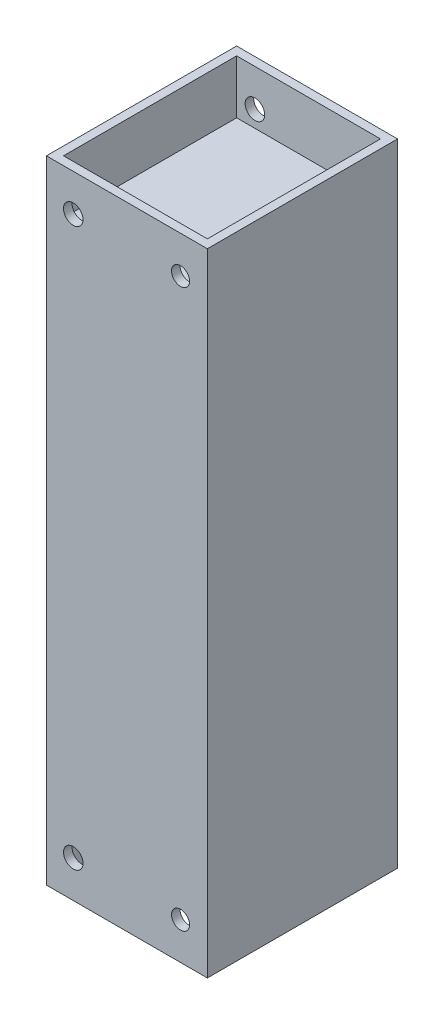
ISO-10303-21;
HEADER;
FILE_DESCRIPTION(('STEP AP214'),'2;1');
FILE_NAME('part.step','',(''),(''),'','','');
FILE_SCHEMA(('AUTOMOTIVE_DESIGN { 1 0 10303 214 1 1 1 1 }'));
ENDSEC;
DATA;
#1=APPLICATION_CONTEXT('core data for automotive mechanical design processes');
#2=APPLICATION_PROTOCOL_DEFINITION('international standard','automotive_design',2000,#1);
#3=PRODUCT_CONTEXT('',#1,'mechanical');
#4=PRODUCT('Part','Part','',(#3));
#5=PRODUCT_RELATED_PRODUCT_CATEGORY('part','',(#4));
#6=PRODUCT_DEFINITION_FORMATION('','',#4);
#7=PRODUCT_DEFINITION_CONTEXT('part definition',#1,'design');
#8=PRODUCT_DEFINITION('design','',#6,#7);
#9=PRODUCT_DEFINITION_SHAPE('','',#8);
#10=(LENGTH_UNIT() NAMED_UNIT(*) SI_UNIT(.MILLI.,.METRE.));
#11=(NAMED_UNIT(*) PLANE_ANGLE_UNIT() SI_UNIT($,.RADIAN.));
#12=(NAMED_UNIT(*) SI_UNIT($,.STERADIAN.) SOLID_ANGLE_UNIT());
#13=UNCERTAINTY_MEASURE_WITH_UNIT(LENGTH_MEASURE(1.E-05),#10,'distance_accuracy_value','');
#14=(GEOMETRIC_REPRESENTATION_CONTEXT(3) GLOBAL_UNCERTAINTY_ASSIGNED_CONTEXT((#13)) GLOBAL_UNIT_ASSIGNED_CONTEXT((#10,
#11,#12)) REPRESENTATION_CONTEXT('',''));
#15=CARTESIAN_POINT('',(0.,0.,0.));
#16=DIRECTION('',(0.,0.,1.));
#17=DIRECTION('',(1.,0.,0.));
#18=AXIS2_PLACEMENT_3D('',#15,#16,#17);
#19=CARTESIAN_POINT('',(-61.5591316556863,13.,4.59211236862001));
#20=DIRECTION('',(1.,0.,0.));
#21=DIRECTION('',(0.,0.,-1.));
#22=AXIS2_PLACEMENT_3D('',#19,#20,#21);
#23=PLANE('',#22);
#24=DIRECTION('',(0.,-1.,0.));
#25=VECTOR('',#24,1.);
#26=CARTESIAN_POINT('',(-61.5591316556863,13.,4.59211236862001));
#27=LINE('',#26,#25);
#28=CARTESIAN_POINT('',(-61.5591316556863,13.,4.59211236862001));
#29=VERTEX_POINT('',#28);
#30=CARTESIAN_POINT('',(-61.5591316556863,-116.499999756,4.59211236862001));
#31=VERTEX_POINT('',#30);
#32=EDGE_CURVE('E62',#29,#31,#27,.T.);
#33=ORIENTED_EDGE('',*,*,#32,.T.);
#34=DIRECTION('',(0.,0.,1.));
#35=VECTOR('',#34,1.);
#36=CARTESIAN_POINT('',(-61.5591316556863,-116.499999756,4.59211236862001));
#37=LINE('',#36,#35);
#38=CARTESIAN_POINT('',(-61.5591316556863,-116.499999756,43.59211236862));
#39=VERTEX_POINT('',#38);
#40=EDGE_CURVE('E167',#31,#39,#37,.T.);
#41=ORIENTED_EDGE('',*,*,#40,.T.);
#42=DIRECTION('',(0.,-1.,0.));
#43=VECTOR('',#42,1.);
#44=CARTESIAN_POINT('',(-61.5591316556863,13.,43.59211236862));
#45=LINE('',#44,#43);
#46=CARTESIAN_POINT('',(-61.5591316556863,13.,43.59211236862));
#47=VERTEX_POINT('',#46);
#48=EDGE_CURVE('E12',#47,#39,#45,.T.);
#49=ORIENTED_EDGE('',*,*,#48,.F.);
#50=DIRECTION('',(0.,0.,1.));
#51=VECTOR('',#50,1.);
#52=CARTESIAN_POINT('',(-61.5591316556863,13.,4.59211236862001));
#53=LINE('',#52,#51);
#54=EDGE_CURVE('E235',#29,#47,#53,.T.);
#55=ORIENTED_EDGE('',*,*,#54,.F.);
#56=EDGE_LOOP('',(#33,#41,#49,#55));
#57=FACE_BOUND('',#56,.T.);
#58=ADVANCED_FACE('F38',(#57),#23,.F.);
#59=CARTESIAN_POINT('',(-61.5591316556863,13.,43.59211236862));
#60=DIRECTION('',(0.,0.,-1.));
#61=DIRECTION('',(-1.,0.,0.));
#62=AXIS2_PLACEMENT_3D('',#59,#60,#61);
#63=PLANE('',#62);
#64=CARTESIAN_POINT('',(-34.0591316556863,5.4,43.59211236862));
#65=DIRECTION('',(0.,0.,1.));
#66=DIRECTION('',(1.,0.,0.));
#67=AXIS2_PLACEMENT_3D('',#64,#65,#66);
#68=CIRCLE('',#67,1.85);
#69=CARTESIAN_POINT('',(-32.2091316556863,5.4,43.59211236862));
#70=VERTEX_POINT('',#69);
#71=EDGE_CURVE('E191',#70,#70,#68,.T.);
#72=ORIENTED_EDGE('',*,*,#71,.F.);
#73=EDGE_LOOP('',(#72));
#74=FACE_BOUND('',#73,.T.);
#75=CARTESIAN_POINT('',(-56.0591316556863,5.4,43.59211236862));
#76=DIRECTION('',(0.,0.,1.));
#77=DIRECTION('',(1.,0.,0.));
#78=AXIS2_PLACEMENT_3D('',#75,#76,#77);
#79=CIRCLE('',#78,2.);
#80=CARTESIAN_POINT('',(-54.0591316556863,5.4,43.59211236862));
#81=VERTEX_POINT('',#80);
#82=EDGE_CURVE('E180',#81,#81,#79,.T.);
#83=ORIENTED_EDGE('',*,*,#82,.F.);
#84=EDGE_LOOP('',(#83));
#85=FACE_BOUND('',#84,.T.);
#86=ORIENTED_EDGE('',*,*,#48,.T.);
#87=DIRECTION('',(1.,0.,0.));
#88=VECTOR('',#87,1.);
#89=CARTESIAN_POINT('',(-61.5591316556863,-116.499999756,43.59211236862));
#90=LINE('',#89,#88);
#91=CARTESIAN_POINT('',(-28.5591316556863,-116.499999756,43.59211236862));
#92=VERTEX_POINT('',#91);
#93=EDGE_CURVE('E171',#39,#92,#90,.T.);
#94=ORIENTED_EDGE('',*,*,#93,.T.);
#95=DIRECTION('',(0.,-1.,0.));
#96=VECTOR('',#95,1.);
#97=CARTESIAN_POINT('',(-28.5591316556863,13.,43.59211236862));
#98=LINE('',#97,#96);
#99=CARTESIAN_POINT('',(-28.5591316556863,13.,43.59211236862));
#100=VERTEX_POINT('',#99);
#101=EDGE_CURVE('E46',#100,#92,#98,.T.);
#102=ORIENTED_EDGE('',*,*,#101,.F.);
#103=DIRECTION('',(1.,0.,0.));
#104=VECTOR('',#103,1.);
#105=CARTESIAN_POINT('',(-61.5591316556863,13.,43.59211236862));
#106=LINE('',#105,#104);
#107=EDGE_CURVE('E238',#47,#100,#106,.T.);
#108=ORIENTED_EDGE('',*,*,#107,.F.);
#109=EDGE_LOOP('',(#86,#94,#102,#108));
#110=FACE_BOUND('',#109,.T.);
#111=CARTESIAN_POINT('',(-34.0591316556863,-108.899999756,43.59211236862));
#112=DIRECTION('',(0.,0.,-1.));
#113=DIRECTION('',(1.,0.,0.));
#114=AXIS2_PLACEMENT_3D('',#111,#112,#113);
#115=CIRCLE('',#114,1.85);
#116=CARTESIAN_POINT('',(-32.2091316556863,-108.899999756,43.59211236862));
#117=VERTEX_POINT('',#116);
#118=EDGE_CURVE('E185',#117,#117,#115,.T.);
#119=ORIENTED_EDGE('',*,*,#118,.T.);
#120=EDGE_LOOP('',(#119));
#121=FACE_BOUND('',#120,.T.);
#122=CARTESIAN_POINT('',(-56.0591316556863,-108.899999756,43.59211236862));
#123=DIRECTION('',(0.,0.,-1.));
#124=DIRECTION('',(1.,0.,0.));
#125=AXIS2_PLACEMENT_3D('',#122,#123,#124);
#126=CIRCLE('',#125,2.);
#127=CARTESIAN_POINT('',(-54.0591316556863,-108.899999756,43.59211236862));
#128=VERTEX_POINT('',#127);
#129=EDGE_CURVE('E386',#128,#128,#126,.T.);
#130=ORIENTED_EDGE('',*,*,#129,.T.);
#131=EDGE_LOOP('',(#130));
#132=FACE_BOUND('',#131,.T.);
#133=ADVANCED_FACE('F273',(#74,#85,#110,#121,#132),#63,.F.);
#134=CARTESIAN_POINT('',(-28.5591316556863,13.,4.59211236862001));
#135=DIRECTION('',(1.,0.,0.));
#136=DIRECTION('',(0.,0.,-1.));
#137=AXIS2_PLACEMENT_3D('',#134,#135,#136);
#138=PLANE('',#137);
#139=ORIENTED_EDGE('',*,*,#101,.T.);
#140=DIRECTION('',(0.,0.,1.));
#141=VECTOR('',#140,1.);
#142=CARTESIAN_POINT('',(-28.5591316556863,-116.499999756,4.59211236862001));
#143=LINE('',#142,#141);
#144=CARTESIAN_POINT('',(-28.5591316556863,-116.499999756,4.59211236862001));
#145=VERTEX_POINT('',#144);
#146=EDGE_CURVE('E174',#145,#92,#143,.T.);
#147=ORIENTED_EDGE('',*,*,#146,.F.);
#148=DIRECTION('',(0.,-1.,0.));
#149=VECTOR('',#148,1.);
#150=CARTESIAN_POINT('',(-28.5591316556863,13.,4.59211236862001));
#151=LINE('',#150,#149);
#152=CARTESIAN_POINT('',(-28.5591316556863,13.,4.59211236862001));
#153=VERTEX_POINT('',#152);
#154=EDGE_CURVE('E246',#153,#145,#151,.T.);
#155=ORIENTED_EDGE('',*,*,#154,.F.);
#156=DIRECTION('',(0.,0.,1.));
#157=VECTOR('',#156,1.);
#158=CARTESIAN_POINT('',(-28.5591316556863,13.,4.59211236862001));
#159=LINE('',#158,#157);
#160=EDGE_CURVE('E240',#153,#100,#159,.T.);
#161=ORIENTED_EDGE('',*,*,#160,.T.);
#162=EDGE_LOOP('',(#139,#147,#155,#161));
#163=FACE_BOUND('',#162,.T.);
#164=ADVANCED_FACE('F278',(#163),#138,.T.);
#165=CARTESIAN_POINT('',(-61.5591316556863,13.,4.59211236862001));
#166=DIRECTION('',(0.,0.,-1.));
#167=DIRECTION('',(-1.,0.,0.));
#168=AXIS2_PLACEMENT_3D('',#165,#166,#167);
#169=PLANE('',#168);
#170=CARTESIAN_POINT('',(-34.0591316556863,5.4,4.59211236862001));
#171=DIRECTION('',(0.,0.,-1.));
#172=DIRECTION('',(-1.,0.,0.));
#173=AXIS2_PLACEMENT_3D('',#170,#171,#172);
#174=CIRCLE('',#173,1.85);
#175=CARTESIAN_POINT('',(-35.9091316556863,5.4,4.59211236862001));
#176=VERTEX_POINT('',#175);
#177=EDGE_CURVE('E206',#176,#176,#174,.T.);
#178=ORIENTED_EDGE('',*,*,#177,.F.);
#179=EDGE_LOOP('',(#178));
#180=FACE_BOUND('',#179,.T.);
#181=CARTESIAN_POINT('',(-56.0591316556863,5.4,4.59211236862001));
#182=DIRECTION('',(0.,0.,-1.));
#183=DIRECTION('',(-1.,0.,0.));
#184=AXIS2_PLACEMENT_3D('',#181,#182,#183);
#185=CIRCLE('',#184,2.);
#186=CARTESIAN_POINT('',(-58.0591316556863,5.4,4.59211236862001));
#187=VERTEX_POINT('',#186);
#188=EDGE_CURVE('E200',#187,#187,#185,.T.);
#189=ORIENTED_EDGE('',*,*,#188,.F.);
#190=EDGE_LOOP('',(#189));
#191=FACE_BOUND('',#190,.T.);
#192=ORIENTED_EDGE('',*,*,#154,.T.);
#193=DIRECTION('',(1.,0.,0.));
#194=VECTOR('',#193,1.);
#195=CARTESIAN_POINT('',(-61.5591316556863,-116.499999756,4.59211236862001));
#196=LINE('',#195,#194);
#197=EDGE_CURVE('E177',#31,#145,#196,.T.);
#198=ORIENTED_EDGE('',*,*,#197,.F.);
#199=ORIENTED_EDGE('',*,*,#32,.F.);
#200=DIRECTION('',(1.,0.,0.));
#201=VECTOR('',#200,1.);
#202=CARTESIAN_POINT('',(-61.5591316556863,13.,4.59211236862001));
#203=LINE('',#202,#201);
#204=EDGE_CURVE('E243',#29,#153,#203,.T.);
#205=ORIENTED_EDGE('',*,*,#204,.T.);
#206=EDGE_LOOP('',(#192,#198,#199,#205));
#207=FACE_BOUND('',#206,.T.);
#208=CARTESIAN_POINT('',(-34.0591316556863,-108.899999756,4.59211236862001));
#209=DIRECTION('',(0.,0.,1.));
#210=DIRECTION('',(-1.,0.,0.));
#211=AXIS2_PLACEMENT_3D('',#208,#209,#210);
#212=CIRCLE('',#211,1.85);
#213=CARTESIAN_POINT('',(-35.9091316556863,-108.899999756,4.59211236862001));
#214=VERTEX_POINT('',#213);
#215=EDGE_CURVE('E156',#214,#214,#212,.T.);
#216=ORIENTED_EDGE('',*,*,#215,.T.);
#217=EDGE_LOOP('',(#216));
#218=FACE_BOUND('',#217,.T.);
#219=CARTESIAN_POINT('',(-56.0591316556863,-108.899999756,4.59211236862001));
#220=DIRECTION('',(0.,0.,1.));
#221=DIRECTION('',(-1.,0.,0.));
#222=AXIS2_PLACEMENT_3D('',#219,#220,#221);
#223=CIRCLE('',#222,2.);
#224=CARTESIAN_POINT('',(-58.0591316556863,-108.899999756,4.59211236862001));
#225=VERTEX_POINT('',#224);
#226=EDGE_CURVE('E190',#225,#225,#223,.T.);
#227=ORIENTED_EDGE('',*,*,#226,.T.);
#228=EDGE_LOOP('',(#227));
#229=FACE_BOUND('',#228,.T.);
#230=ADVANCED_FACE('F283',(#180,#191,#207,#218,#229),#169,.T.);
#231=CARTESIAN_POINT('',(0.,13.,0.));
#232=DIRECTION('',(0.,1.,0.));
#233=DIRECTION('',(0.,0.,1.));
#234=AXIS2_PLACEMENT_3D('',#231,#232,#233);
#235=PLANE('',#234);
#236=DIRECTION('',(0.,0.,1.));
#237=VECTOR('',#236,1.);
#238=CARTESIAN_POINT('',(-59.8091316556863,13.,6.34211236862001));
#239=LINE('',#238,#237);
#240=CARTESIAN_POINT('',(-59.8091316556863,13.,6.34211236862001));
#241=VERTEX_POINT('',#240);
#242=CARTESIAN_POINT('',(-59.8091316556863,13.,41.84211236862));
#243=VERTEX_POINT('',#242);
#244=EDGE_CURVE('E54',#241,#243,#239,.T.);
#245=ORIENTED_EDGE('',*,*,#244,.F.);
#246=DIRECTION('',(-1.,0.,0.));
#247=VECTOR('',#246,1.);
#248=CARTESIAN_POINT('',(-59.8091316556863,13.,6.34211236862001));
#249=LINE('',#248,#247);
#250=CARTESIAN_POINT('',(-30.3091316556863,13.,6.34211236862001));
#251=VERTEX_POINT('',#250);
#252=EDGE_CURVE('E224',#251,#241,#249,.T.);
#253=ORIENTED_EDGE('',*,*,#252,.F.);
#254=DIRECTION('',(0.,0.,-1.));
#255=VECTOR('',#254,1.);
#256=CARTESIAN_POINT('',(-30.3091316556863,13.,6.34211236862001));
#257=LINE('',#256,#255);
#258=CARTESIAN_POINT('',(-30.3091316556863,13.,41.84211236862));
#259=VERTEX_POINT('',#258);
#260=EDGE_CURVE('E221',#259,#251,#257,.T.);
#261=ORIENTED_EDGE('',*,*,#260,.F.);
#262=DIRECTION('',(1.,0.,0.));
#263=VECTOR('',#262,1.);
#264=CARTESIAN_POINT('',(-59.8091316556863,13.,41.84211236862));
#265=LINE('',#264,#263);
#266=EDGE_CURVE('E218',#243,#259,#265,.T.);
#267=ORIENTED_EDGE('',*,*,#266,.F.);
#268=EDGE_LOOP('',(#245,#253,#261,#267));
#269=FACE_BOUND('',#268,.T.);
#270=ORIENTED_EDGE('',*,*,#54,.T.);
#271=ORIENTED_EDGE('',*,*,#107,.T.);
#272=ORIENTED_EDGE('',*,*,#160,.F.);
#273=ORIENTED_EDGE('',*,*,#204,.F.);
#274=EDGE_LOOP('',(#270,#271,#272,#273));
#275=FACE_BOUND('',#274,.T.);
#276=ADVANCED_FACE('F292',(#269,#275),#235,.T.);
#277=CARTESIAN_POINT('',(-59.8091316556863,-46.1573396113771,6.34211236862001));
#278=DIRECTION('',(-1.,0.,0.));
#279=DIRECTION('',(0.,0.,1.));
#280=AXIS2_PLACEMENT_3D('',#277,#278,#279);
#281=PLANE('',#280);
#282=DIRECTION('',(0.,0.,-1.));
#283=VECTOR('',#282,1.);
#284=CARTESIAN_POINT('',(-59.8091316556863,2.,6.34211236862001));
#285=LINE('',#284,#283);
#286=CARTESIAN_POINT('',(-59.8091316556863,2.,41.84211236862));
#287=VERTEX_POINT('',#286);
#288=CARTESIAN_POINT('',(-59.8091316556863,2.,6.34211236862001));
#289=VERTEX_POINT('',#288);
#290=EDGE_CURVE('E214',#287,#289,#285,.T.);
#291=ORIENTED_EDGE('',*,*,#290,.T.);
#292=DIRECTION('',(0.,1.,0.));
#293=VECTOR('',#292,1.);
#294=CARTESIAN_POINT('',(-59.8091316556863,-46.1573396113771,6.34211236862001));
#295=LINE('',#294,#293);
#296=EDGE_CURVE('E212',#289,#241,#295,.T.);
#297=ORIENTED_EDGE('',*,*,#296,.T.);
#298=ORIENTED_EDGE('',*,*,#244,.T.);
#299=DIRECTION('',(0.,1.,0.));
#300=VECTOR('',#299,1.);
#301=CARTESIAN_POINT('',(-59.8091316556863,-46.1573396113771,41.84211236862));
#302=LINE('',#301,#300);
#303=EDGE_CURVE('E227',#287,#243,#302,.T.);
#304=ORIENTED_EDGE('',*,*,#303,.F.);
#305=EDGE_LOOP('',(#291,#297,#298,#304));
#306=FACE_BOUND('',#305,.T.);
#307=ADVANCED_FACE('F304',(#306),#281,.F.);
#308=CARTESIAN_POINT('',(-59.8091316556863,-46.1573396113771,6.34211236862001));
#309=DIRECTION('',(0.,0.,-1.));
#310=DIRECTION('',(-1.,0.,0.));
#311=AXIS2_PLACEMENT_3D('',#308,#309,#310);
#312=PLANE('',#311);
#313=CARTESIAN_POINT('',(-34.0591316556863,5.4,6.34211236862001));
#314=DIRECTION('',(0.,0.,-1.));
#315=DIRECTION('',(-1.,0.,0.));
#316=AXIS2_PLACEMENT_3D('',#313,#314,#315);
#317=CIRCLE('',#316,1.85);
#318=CARTESIAN_POINT('',(-35.9091316556863,5.4,6.34211236862001));
#319=VERTEX_POINT('',#318);
#320=EDGE_CURVE('E203',#319,#319,#317,.T.);
#321=ORIENTED_EDGE('',*,*,#320,.T.);
#322=EDGE_LOOP('',(#321));
#323=FACE_BOUND('',#322,.T.);
#324=CARTESIAN_POINT('',(-56.0591316556863,5.4,6.34211236862001));
#325=DIRECTION('',(0.,0.,-1.));
#326=DIRECTION('',(-1.,0.,0.));
#327=AXIS2_PLACEMENT_3D('',#324,#325,#326);
#328=CIRCLE('',#327,2.);
#329=CARTESIAN_POINT('',(-58.0591316556863,5.4,6.34211236862001));
#330=VERTEX_POINT('',#329);
#331=EDGE_CURVE('E197',#330,#330,#328,.T.);
#332=ORIENTED_EDGE('',*,*,#331,.T.);
#333=EDGE_LOOP('',(#332));
#334=FACE_BOUND('',#333,.T.);
#335=DIRECTION('',(1.,0.,0.));
#336=VECTOR('',#335,1.);
#337=CARTESIAN_POINT('',(-59.8091316556863,2.,6.34211236862001));
#338=LINE('',#337,#336);
#339=CARTESIAN_POINT('',(-30.3091316556863,2.,6.34211236862001));
#340=VERTEX_POINT('',#339);
#341=EDGE_CURVE('E211',#289,#340,#338,.T.);
#342=ORIENTED_EDGE('',*,*,#341,.T.);
#343=DIRECTION('',(0.,1.,0.));
#344=VECTOR('',#343,1.);
#345=CARTESIAN_POINT('',(-30.3091316556863,-46.1573396113771,6.34211236862001));
#346=LINE('',#345,#344);
#347=EDGE_CURVE('E229',#340,#251,#346,.T.);
#348=ORIENTED_EDGE('',*,*,#347,.T.);
#349=ORIENTED_EDGE('',*,*,#252,.T.);
#350=ORIENTED_EDGE('',*,*,#296,.F.);
#351=EDGE_LOOP('',(#342,#348,#349,#350));
#352=FACE_BOUND('',#351,.T.);
#353=ADVANCED_FACE('F308',(#323,#334,#352),#312,.F.);
#354=CARTESIAN_POINT('',(-30.3091316556863,-46.1573396113771,6.34211236862001));
#355=DIRECTION('',(1.,0.,0.));
#356=DIRECTION('',(0.,0.,-1.));
#357=AXIS2_PLACEMENT_3D('',#354,#355,#356);
#358=PLANE('',#357);
#359=DIRECTION('',(0.,0.,1.));
#360=VECTOR('',#359,1.);
#361=CARTESIAN_POINT('',(-30.3091316556863,2.,6.34211236862001));
#362=LINE('',#361,#360);
#363=CARTESIAN_POINT('',(-30.3091316556863,2.,41.84211236862));
#364=VERTEX_POINT('',#363);
#365=EDGE_CURVE('E209',#340,#364,#362,.T.);
#366=ORIENTED_EDGE('',*,*,#365,.T.);
#367=DIRECTION('',(0.,1.,0.));
#368=VECTOR('',#367,1.);
#369=CARTESIAN_POINT('',(-30.3091316556863,-46.1573396113771,41.84211236862));
#370=LINE('',#369,#368);
#371=EDGE_CURVE('E231',#364,#259,#370,.T.);
#372=ORIENTED_EDGE('',*,*,#371,.T.);
#373=ORIENTED_EDGE('',*,*,#260,.T.);
#374=ORIENTED_EDGE('',*,*,#347,.F.);
#375=EDGE_LOOP('',(#366,#372,#373,#374));
#376=FACE_BOUND('',#375,.T.);
#377=ADVANCED_FACE('F311',(#376),#358,.F.);
#378=CARTESIAN_POINT('',(-59.8091316556863,-46.1573396113771,41.84211236862));
#379=DIRECTION('',(0.,0.,1.));
#380=DIRECTION('',(1.,0.,0.));
#381=AXIS2_PLACEMENT_3D('',#378,#379,#380);
#382=PLANE('',#381);
#383=CARTESIAN_POINT('',(-34.0591316556863,5.4,41.84211236862));
#384=DIRECTION('',(0.,0.,1.));
#385=DIRECTION('',(1.,0.,0.));
#386=AXIS2_PLACEMENT_3D('',#383,#384,#385);
#387=CIRCLE('',#386,1.85);
#388=CARTESIAN_POINT('',(-32.2091316556863,5.4,41.84211236862));
#389=VERTEX_POINT('',#388);
#390=EDGE_CURVE('E41',#389,#389,#387,.T.);
#391=ORIENTED_EDGE('',*,*,#390,.T.);
#392=EDGE_LOOP('',(#391));
#393=FACE_BOUND('',#392,.T.);
#394=CARTESIAN_POINT('',(-56.0591316556863,5.4,41.84211236862));
#395=DIRECTION('',(0.,0.,1.));
#396=DIRECTION('',(1.,0.,0.));
#397=AXIS2_PLACEMENT_3D('',#394,#395,#396);
#398=CIRCLE('',#397,2.);
#399=CARTESIAN_POINT('',(-54.0591316556863,5.4,41.84211236862));
#400=VERTEX_POINT('',#399);
#401=EDGE_CURVE('E194',#400,#400,#398,.T.);
#402=ORIENTED_EDGE('',*,*,#401,.T.);
#403=EDGE_LOOP('',(#402));
#404=FACE_BOUND('',#403,.T.);
#405=DIRECTION('',(-1.,0.,0.));
#406=VECTOR('',#405,1.);
#407=CARTESIAN_POINT('',(-59.8091316556863,2.,41.84211236862));
#408=LINE('',#407,#406);
#409=EDGE_CURVE('E216',#364,#287,#408,.T.);
#410=ORIENTED_EDGE('',*,*,#409,.T.);
#411=ORIENTED_EDGE('',*,*,#303,.T.);
#412=ORIENTED_EDGE('',*,*,#266,.T.);
#413=ORIENTED_EDGE('',*,*,#371,.F.);
#414=EDGE_LOOP('',(#410,#411,#412,#413));
#415=FACE_BOUND('',#414,.T.);
#416=ADVANCED_FACE('F251',(#393,#404,#415),#382,.F.);
#417=CARTESIAN_POINT('',(0.,2.,0.));
#418=DIRECTION('',(0.,1.,0.));
#419=DIRECTION('',(0.,0.,1.));
#420=AXIS2_PLACEMENT_3D('',#417,#418,#419);
#421=PLANE('',#420);
#422=ORIENTED_EDGE('',*,*,#290,.F.);
#423=ORIENTED_EDGE('',*,*,#409,.F.);
#424=ORIENTED_EDGE('',*,*,#365,.F.);
#425=ORIENTED_EDGE('',*,*,#341,.F.);
#426=EDGE_LOOP('',(#422,#423,#424,#425));
#427=FACE_BOUND('',#426,.T.);
#428=ADVANCED_FACE('F257',(#427),#421,.T.);
#429=CARTESIAN_POINT('',(-56.0591316556863,5.4,-13.40788763138));
#430=DIRECTION('',(0.,0.,1.));
#431=DIRECTION('',(1.,0.,0.));
#432=AXIS2_PLACEMENT_3D('',#429,#430,#431);
#433=CYLINDRICAL_SURFACE('',#432,2.);
#434=ORIENTED_EDGE('',*,*,#82,.T.);
#435=EDGE_LOOP('',(#434));
#436=FACE_BOUND('',#435,.T.);
#437=ORIENTED_EDGE('',*,*,#401,.F.);
#438=EDGE_LOOP('',(#437));
#439=FACE_BOUND('',#438,.T.);
#440=ADVANCED_FACE('F254',(#436,#439),#433,.F.);
#441=CARTESIAN_POINT('',(-34.0591316556863,5.4,-13.40788763138));
#442=DIRECTION('',(0.,0.,1.));
#443=DIRECTION('',(1.,0.,0.));
#444=AXIS2_PLACEMENT_3D('',#441,#442,#443);
#445=CYLINDRICAL_SURFACE('',#444,1.85);
#446=ORIENTED_EDGE('',*,*,#71,.T.);
#447=EDGE_LOOP('',(#446));
#448=FACE_BOUND('',#447,.T.);
#449=ORIENTED_EDGE('',*,*,#390,.F.);
#450=EDGE_LOOP('',(#449));
#451=FACE_BOUND('',#450,.T.);
#452=ADVANCED_FACE('F256',(#448,#451),#445,.F.);
#453=ORIENTED_EDGE('',*,*,#188,.T.);
#454=EDGE_LOOP('',(#453));
#455=FACE_BOUND('',#454,.T.);
#456=ORIENTED_EDGE('',*,*,#331,.F.);
#457=EDGE_LOOP('',(#456));
#458=FACE_BOUND('',#457,.T.);
#459=ADVANCED_FACE('F260',(#455,#458),#433,.F.);
#460=ORIENTED_EDGE('',*,*,#177,.T.);
#461=EDGE_LOOP('',(#460));
#462=FACE_BOUND('',#461,.T.);
#463=ORIENTED_EDGE('',*,*,#320,.F.);
#464=EDGE_LOOP('',(#463));
#465=FACE_BOUND('',#464,.T.);
#466=ADVANCED_FACE('F267',(#462,#465),#445,.F.);
#467=CARTESIAN_POINT('',(0.,-116.499999756,0.));
#468=DIRECTION('',(0.,-1.,0.));
#469=DIRECTION('',(0.,0.,1.));
#470=AXIS2_PLACEMENT_3D('',#467,#468,#469);
#471=PLANE('',#470);
#472=DIRECTION('',(0.,0.,1.));
#473=VECTOR('',#472,1.);
#474=CARTESIAN_POINT('',(-59.8091316556863,-116.499999756,6.34211236862001));
#475=LINE('',#474,#473);
#476=CARTESIAN_POINT('',(-59.8091316556863,-116.499999756,6.34211236862001));
#477=VERTEX_POINT('',#476);
#478=CARTESIAN_POINT('',(-59.8091316556863,-116.499999756,41.84211236862));
#479=VERTEX_POINT('',#478);
#480=EDGE_CURVE('E154',#477,#479,#475,.T.);
#481=ORIENTED_EDGE('',*,*,#480,.T.);
#482=DIRECTION('',(1.,0.,0.));
#483=VECTOR('',#482,1.);
#484=CARTESIAN_POINT('',(-59.8091316556863,-116.499999756,41.84211236862));
#485=LINE('',#484,#483);
#486=CARTESIAN_POINT('',(-30.3091316556863,-116.499999756,41.84211236862));
#487=VERTEX_POINT('',#486);
#488=EDGE_CURVE('E134',#479,#487,#485,.T.);
#489=ORIENTED_EDGE('',*,*,#488,.T.);
#490=DIRECTION('',(0.,0.,-1.));
#491=VECTOR('',#490,1.);
#492=CARTESIAN_POINT('',(-30.3091316556863,-116.499999756,6.34211236862001));
#493=LINE('',#492,#491);
#494=CARTESIAN_POINT('',(-30.3091316556863,-116.499999756,6.34211236862001));
#495=VERTEX_POINT('',#494);
#496=EDGE_CURVE('E143',#487,#495,#493,.T.);
#497=ORIENTED_EDGE('',*,*,#496,.T.);
#498=DIRECTION('',(-1.,0.,0.));
#499=VECTOR('',#498,1.);
#500=CARTESIAN_POINT('',(-59.8091316556863,-116.499999756,6.34211236862001));
#501=LINE('',#500,#499);
#502=EDGE_CURVE('E149',#495,#477,#501,.T.);
#503=ORIENTED_EDGE('',*,*,#502,.T.);
#504=EDGE_LOOP('',(#481,#489,#497,#503));
#505=FACE_BOUND('',#504,.T.);
#506=ORIENTED_EDGE('',*,*,#40,.F.);
#507=ORIENTED_EDGE('',*,*,#197,.T.);
#508=ORIENTED_EDGE('',*,*,#146,.T.);
#509=ORIENTED_EDGE('',*,*,#93,.F.);
#510=EDGE_LOOP('',(#506,#507,#508,#509));
#511=FACE_BOUND('',#510,.T.);
#512=ADVANCED_FACE('F151',(#505,#511),#471,.T.);
#513=CARTESIAN_POINT('',(-59.8091316556863,-57.3426601446229,6.34211236862001));
#514=DIRECTION('',(-1.,0.,0.));
#515=DIRECTION('',(0.,0.,1.));
#516=AXIS2_PLACEMENT_3D('',#513,#514,#515);
#517=PLANE('',#516);
#518=DIRECTION('',(0.,0.,-1.));
#519=VECTOR('',#518,1.);
#520=CARTESIAN_POINT('',(-59.8091316556863,-105.499999756,6.34211236862001));
#521=LINE('',#520,#519);
#522=CARTESIAN_POINT('',(-59.8091316556863,-105.499999756,41.84211236862));
#523=VERTEX_POINT('',#522);
#524=CARTESIAN_POINT('',(-59.8091316556863,-105.499999756,6.34211236862001));
#525=VERTEX_POINT('',#524);
#526=EDGE_CURVE('E168',#523,#525,#521,.T.);
#527=ORIENTED_EDGE('',*,*,#526,.F.);
#528=DIRECTION('',(0.,-1.,0.));
#529=VECTOR('',#528,1.);
#530=CARTESIAN_POINT('',(-59.8091316556863,-57.3426601446229,41.84211236862));
#531=LINE('',#530,#529);
#532=EDGE_CURVE('E140',#523,#479,#531,.T.);
#533=ORIENTED_EDGE('',*,*,#532,.T.);
#534=ORIENTED_EDGE('',*,*,#480,.F.);
#535=DIRECTION('',(0.,-1.,0.));
#536=VECTOR('',#535,1.);
#537=CARTESIAN_POINT('',(-59.8091316556863,-57.3426601446229,6.34211236862001));
#538=LINE('',#537,#536);
#539=EDGE_CURVE('E161',#525,#477,#538,.T.);
#540=ORIENTED_EDGE('',*,*,#539,.F.);
#541=EDGE_LOOP('',(#527,#533,#534,#540));
#542=FACE_BOUND('',#541,.T.);
#543=ADVANCED_FACE('F341',(#542),#517,.F.);
#544=CARTESIAN_POINT('',(-59.8091316556863,-57.3426601446229,6.34211236862001));
#545=DIRECTION('',(0.,0.,-1.));
#546=DIRECTION('',(-1.,0.,0.));
#547=AXIS2_PLACEMENT_3D('',#544,#545,#546);
#548=PLANE('',#547);
#549=CARTESIAN_POINT('',(-34.0591316556863,-108.899999756,6.34211236862001));
#550=DIRECTION('',(0.,0.,1.));
#551=DIRECTION('',(-1.,0.,0.));
#552=AXIS2_PLACEMENT_3D('',#549,#550,#551);
#553=CIRCLE('',#552,1.85);
#554=CARTESIAN_POINT('',(-35.9091316556863,-108.899999756,6.34211236862001));
#555=VERTEX_POINT('',#554);
#556=EDGE_CURVE('E189',#555,#555,#553,.T.);
#557=ORIENTED_EDGE('',*,*,#556,.F.);
#558=EDGE_LOOP('',(#557));
#559=FACE_BOUND('',#558,.T.);
#560=CARTESIAN_POINT('',(-56.0591316556863,-108.899999756,6.34211236862001));
#561=DIRECTION('',(0.,0.,1.));
#562=DIRECTION('',(-1.,0.,0.));
#563=AXIS2_PLACEMENT_3D('',#560,#561,#562);
#564=CIRCLE('',#563,2.);
#565=CARTESIAN_POINT('',(-58.0591316556863,-108.899999756,6.34211236862001));
#566=VERTEX_POINT('',#565);
#567=EDGE_CURVE('E184',#566,#566,#564,.T.);
#568=ORIENTED_EDGE('',*,*,#567,.F.);
#569=EDGE_LOOP('',(#568));
#570=FACE_BOUND('',#569,.T.);
#571=DIRECTION('',(1.,0.,0.));
#572=VECTOR('',#571,1.);
#573=CARTESIAN_POINT('',(-59.8091316556863,-105.499999756,6.34211236862001));
#574=LINE('',#573,#572);
#575=CARTESIAN_POINT('',(-30.3091316556863,-105.499999756,6.34211236862001));
#576=VERTEX_POINT('',#575);
#577=EDGE_CURVE('E400',#525,#576,#574,.T.);
#578=ORIENTED_EDGE('',*,*,#577,.F.);
#579=ORIENTED_EDGE('',*,*,#539,.T.);
#580=ORIENTED_EDGE('',*,*,#502,.F.);
#581=DIRECTION('',(0.,-1.,0.));
#582=VECTOR('',#581,1.);
#583=CARTESIAN_POINT('',(-30.3091316556863,-57.3426601446229,6.34211236862001));
#584=LINE('',#583,#582);
#585=EDGE_CURVE('E139',#576,#495,#584,.T.);
#586=ORIENTED_EDGE('',*,*,#585,.F.);
#587=EDGE_LOOP('',(#578,#579,#580,#586));
#588=FACE_BOUND('',#587,.T.);
#589=ADVANCED_FACE('F346',(#559,#570,#588),#548,.F.);
#590=CARTESIAN_POINT('',(-30.3091316556863,-57.3426601446229,6.34211236862001));
#591=DIRECTION('',(1.,0.,0.));
#592=DIRECTION('',(0.,0.,-1.));
#593=AXIS2_PLACEMENT_3D('',#590,#591,#592);
#594=PLANE('',#593);
#595=DIRECTION('',(0.,0.,1.));
#596=VECTOR('',#595,1.);
#597=CARTESIAN_POINT('',(-30.3091316556863,-105.499999756,6.34211236862001));
#598=LINE('',#597,#596);
#599=CARTESIAN_POINT('',(-30.3091316556863,-105.499999756,41.84211236862));
#600=VERTEX_POINT('',#599);
#601=EDGE_CURVE('E163',#576,#600,#598,.T.);
#602=ORIENTED_EDGE('',*,*,#601,.F.);
#603=ORIENTED_EDGE('',*,*,#585,.T.);
#604=ORIENTED_EDGE('',*,*,#496,.F.);
#605=DIRECTION('',(0.,-1.,0.));
#606=VECTOR('',#605,1.);
#607=CARTESIAN_POINT('',(-30.3091316556863,-57.3426601446229,41.84211236862));
#608=LINE('',#607,#606);
#609=EDGE_CURVE('E129',#600,#487,#608,.T.);
#610=ORIENTED_EDGE('',*,*,#609,.F.);
#611=EDGE_LOOP('',(#602,#603,#604,#610));
#612=FACE_BOUND('',#611,.T.);
#613=ADVANCED_FACE('F144',(#612),#594,.F.);
#614=CARTESIAN_POINT('',(-59.8091316556863,-57.3426601446229,41.84211236862));
#615=DIRECTION('',(0.,0.,1.));
#616=DIRECTION('',(1.,0.,0.));
#617=AXIS2_PLACEMENT_3D('',#614,#615,#616);
#618=PLANE('',#617);
#619=CARTESIAN_POINT('',(-34.0591316556863,-108.899999756,41.84211236862));
#620=DIRECTION('',(0.,0.,-1.));
#621=DIRECTION('',(1.,0.,0.));
#622=AXIS2_PLACEMENT_3D('',#619,#620,#621);
#623=CIRCLE('',#622,1.85);
#624=CARTESIAN_POINT('',(-32.2091316556863,-108.899999756,41.84211236862));
#625=VERTEX_POINT('',#624);
#626=EDGE_CURVE('E186',#625,#625,#623,.T.);
#627=ORIENTED_EDGE('',*,*,#626,.F.);
#628=EDGE_LOOP('',(#627));
#629=FACE_BOUND('',#628,.T.);
#630=CARTESIAN_POINT('',(-56.0591316556863,-108.899999756,41.84211236862));
#631=DIRECTION('',(0.,0.,-1.));
#632=DIRECTION('',(1.,0.,0.));
#633=AXIS2_PLACEMENT_3D('',#630,#631,#632);
#634=CIRCLE('',#633,2.);
#635=CARTESIAN_POINT('',(-54.0591316556863,-108.899999756,41.84211236862));
#636=VERTEX_POINT('',#635);
#637=EDGE_CURVE('E181',#636,#636,#634,.T.);
#638=ORIENTED_EDGE('',*,*,#637,.F.);
#639=EDGE_LOOP('',(#638));
#640=FACE_BOUND('',#639,.T.);
#641=DIRECTION('',(-1.,0.,0.));
#642=VECTOR('',#641,1.);
#643=CARTESIAN_POINT('',(-59.8091316556863,-105.499999756,41.84211236862));
#644=LINE('',#643,#642);
#645=EDGE_CURVE('E136',#600,#523,#644,.T.);
#646=ORIENTED_EDGE('',*,*,#645,.F.);
#647=ORIENTED_EDGE('',*,*,#609,.T.);
#648=ORIENTED_EDGE('',*,*,#488,.F.);
#649=ORIENTED_EDGE('',*,*,#532,.F.);
#650=EDGE_LOOP('',(#646,#647,#648,#649));
#651=FACE_BOUND('',#650,.T.);
#652=ADVANCED_FACE('F131',(#629,#640,#651),#618,.F.);
#653=CARTESIAN_POINT('',(0.,-105.499999756,0.));
#654=DIRECTION('',(0.,-1.,0.));
#655=DIRECTION('',(0.,0.,1.));
#656=AXIS2_PLACEMENT_3D('',#653,#654,#655);
#657=PLANE('',#656);
#658=ORIENTED_EDGE('',*,*,#526,.T.);
#659=ORIENTED_EDGE('',*,*,#577,.T.);
#660=ORIENTED_EDGE('',*,*,#601,.T.);
#661=ORIENTED_EDGE('',*,*,#645,.T.);
#662=EDGE_LOOP('',(#658,#659,#660,#661));
#663=FACE_BOUND('',#662,.T.);
#664=ADVANCED_FACE('F350',(#663),#657,.T.);
#665=CARTESIAN_POINT('',(-56.0591316556863,-108.899999756,-13.40788763138));
#666=DIRECTION('',(0.,0.,1.));
#667=DIRECTION('',(1.,0.,0.));
#668=AXIS2_PLACEMENT_3D('',#665,#666,#667);
#669=CYLINDRICAL_SURFACE('',#668,2.);
#670=ORIENTED_EDGE('',*,*,#129,.F.);
#671=EDGE_LOOP('',(#670));
#672=FACE_BOUND('',#671,.T.);
#673=ORIENTED_EDGE('',*,*,#637,.T.);
#674=EDGE_LOOP('',(#673));
#675=FACE_BOUND('',#674,.T.);
#676=ADVANCED_FACE('F359',(#672,#675),#669,.F.);
#677=CARTESIAN_POINT('',(-34.0591316556863,-108.899999756,-13.40788763138));
#678=DIRECTION('',(0.,0.,1.));
#679=DIRECTION('',(1.,0.,0.));
#680=AXIS2_PLACEMENT_3D('',#677,#678,#679);
#681=CYLINDRICAL_SURFACE('',#680,1.85);
#682=ORIENTED_EDGE('',*,*,#118,.F.);
#683=EDGE_LOOP('',(#682));
#684=FACE_BOUND('',#683,.T.);
#685=ORIENTED_EDGE('',*,*,#626,.T.);
#686=EDGE_LOOP('',(#685));
#687=FACE_BOUND('',#686,.T.);
#688=ADVANCED_FACE('F365',(#684,#687),#681,.F.);
#689=ORIENTED_EDGE('',*,*,#226,.F.);
#690=EDGE_LOOP('',(#689));
#691=FACE_BOUND('',#690,.T.);
#692=ORIENTED_EDGE('',*,*,#567,.T.);
#693=EDGE_LOOP('',(#692));
#694=FACE_BOUND('',#693,.T.);
#695=ADVANCED_FACE('F361',(#691,#694),#669,.F.);
#696=ORIENTED_EDGE('',*,*,#215,.F.);
#697=EDGE_LOOP('',(#696));
#698=FACE_BOUND('',#697,.T.);
#699=ORIENTED_EDGE('',*,*,#556,.T.);
#700=EDGE_LOOP('',(#699));
#701=FACE_BOUND('',#700,.T.);
#702=ADVANCED_FACE('F364',(#698,#701),#681,.F.);
#703=CLOSED_SHELL('',(#58,#133,#164,#230,#276,#307,#353,#377,#416,#428,#440,#452,#459,#466,#512,
#543,#589,#613,#652,#664,#676,#688,#695,#702));
#704=MANIFOLD_SOLID_BREP('B2',#703);
#705=ADVANCED_BREP_SHAPE_REPRESENTATION('',(#18,#704),#14);
#706=SHAPE_DEFINITION_REPRESENTATION(#9,#705);
ENDSEC;
END-ISO-10303-21;
